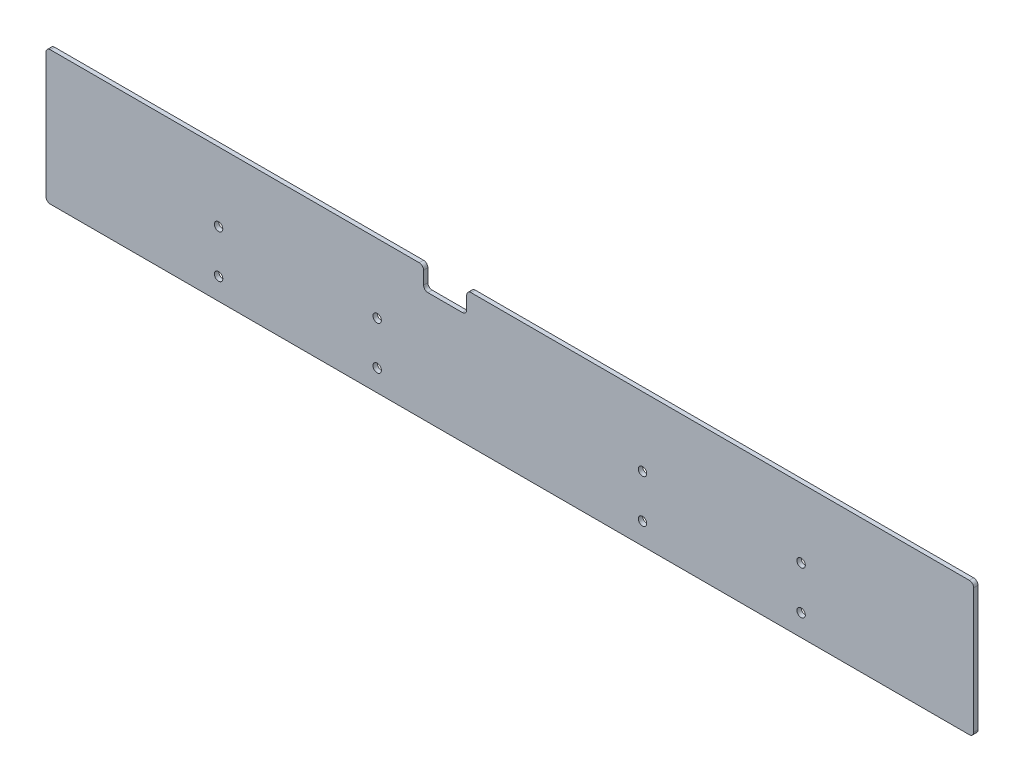
ISO-10303-21;
HEADER;
FILE_DESCRIPTION(('STEP AP214'),'2;1');
FILE_NAME('part.step','',(''),(''),'','','');
FILE_SCHEMA(('AUTOMOTIVE_DESIGN { 1 0 10303 214 1 1 1 1 }'));
ENDSEC;
DATA;
#1=APPLICATION_CONTEXT('core data for automotive mechanical design processes');
#2=APPLICATION_PROTOCOL_DEFINITION('international standard','automotive_design',2000,#1);
#3=PRODUCT_CONTEXT('',#1,'mechanical');
#4=PRODUCT('Part','Part','',(#3));
#5=PRODUCT_RELATED_PRODUCT_CATEGORY('part','',(#4));
#6=PRODUCT_DEFINITION_FORMATION('','',#4);
#7=PRODUCT_DEFINITION_CONTEXT('part definition',#1,'design');
#8=PRODUCT_DEFINITION('design','',#6,#7);
#9=PRODUCT_DEFINITION_SHAPE('','',#8);
#10=(LENGTH_UNIT() NAMED_UNIT(*) SI_UNIT(.MILLI.,.METRE.));
#11=(NAMED_UNIT(*) PLANE_ANGLE_UNIT() SI_UNIT($,.RADIAN.));
#12=(NAMED_UNIT(*) SI_UNIT($,.STERADIAN.) SOLID_ANGLE_UNIT());
#13=UNCERTAINTY_MEASURE_WITH_UNIT(LENGTH_MEASURE(1.E-05),#10,'distance_accuracy_value','');
#14=(GEOMETRIC_REPRESENTATION_CONTEXT(3) GLOBAL_UNCERTAINTY_ASSIGNED_CONTEXT((#13)) GLOBAL_UNIT_ASSIGNED_CONTEXT((#10,
#11,#12)) REPRESENTATION_CONTEXT('',''));
#15=CARTESIAN_POINT('',(0.,0.,0.));
#16=DIRECTION('',(0.,0.,1.));
#17=DIRECTION('',(1.,0.,0.));
#18=AXIS2_PLACEMENT_3D('',#15,#16,#17);
#19=CARTESIAN_POINT('',(0.,0.,2.));
#20=DIRECTION('',(0.,0.,1.));
#21=DIRECTION('',(1.,0.,0.));
#22=AXIS2_PLACEMENT_3D('',#19,#20,#21);
#23=PLANE('',#22);
#24=CARTESIAN_POINT('',(-276.905896290942,-34.2964824120603,2.));
#25=DIRECTION('',(0.,0.,1.));
#26=DIRECTION('',(1.,0.,0.));
#27=AXIS2_PLACEMENT_3D('',#24,#25,#26);
#28=CIRCLE('',#27,1.95000000000003);
#29=CARTESIAN_POINT('',(-274.955896290942,-34.2964824120603,2.));
#30=VERTEX_POINT('',#29);
#31=EDGE_CURVE('E613',#30,#30,#28,.T.);
#32=ORIENTED_EDGE('',*,*,#31,.F.);
#33=EDGE_LOOP('',(#32));
#34=FACE_BOUND('',#33,.T.);
#35=CARTESIAN_POINT('',(-6.905896290942,-14.2964824120603,2.));
#36=DIRECTION('',(0.,0.,1.));
#37=DIRECTION('',(1.,0.,0.));
#38=AXIS2_PLACEMENT_3D('',#35,#36,#37);
#39=CIRCLE('',#38,1.95);
#40=CARTESIAN_POINT('',(-4.955896290942,-14.2964824120603,2.));
#41=VERTEX_POINT('',#40);
#42=EDGE_CURVE('E614',#41,#41,#39,.T.);
#43=ORIENTED_EDGE('',*,*,#42,.F.);
#44=EDGE_LOOP('',(#43));
#45=FACE_BOUND('',#44,.T.);
#46=CARTESIAN_POINT('',(-6.905896290942,-34.2964824120603,2.));
#47=DIRECTION('',(0.,0.,1.));
#48=DIRECTION('',(1.,0.,0.));
#49=AXIS2_PLACEMENT_3D('',#46,#47,#48);
#50=CIRCLE('',#49,1.95);
#51=CARTESIAN_POINT('',(-4.955896290942,-34.2964824120603,2.));
#52=VERTEX_POINT('',#51);
#53=EDGE_CURVE('E618',#52,#52,#50,.T.);
#54=ORIENTED_EDGE('',*,*,#53,.F.);
#55=EDGE_LOOP('',(#54));
#56=FACE_BOUND('',#55,.T.);
#57=CARTESIAN_POINT('',(-276.905896290942,-14.2964824120603,2.));
#58=DIRECTION('',(0.,0.,1.));
#59=DIRECTION('',(1.,0.,0.));
#60=AXIS2_PLACEMENT_3D('',#57,#58,#59);
#61=CIRCLE('',#60,1.95000000000003);
#62=CARTESIAN_POINT('',(-274.955896290942,-14.2964824120603,2.));
#63=VERTEX_POINT('',#62);
#64=EDGE_CURVE('E248',#63,#63,#61,.T.);
#65=ORIENTED_EDGE('',*,*,#64,.F.);
#66=EDGE_LOOP('',(#65));
#67=FACE_BOUND('',#66,.T.);
#68=CARTESIAN_POINT('',(-203.405896290942,-14.2964824120603,2.));
#69=DIRECTION('',(0.,0.,1.));
#70=DIRECTION('',(1.,0.,0.));
#71=AXIS2_PLACEMENT_3D('',#68,#69,#70);
#72=CIRCLE('',#71,1.95);
#73=CARTESIAN_POINT('',(-201.455896290942,-14.2964824120603,2.));
#74=VERTEX_POINT('',#73);
#75=EDGE_CURVE('E268',#74,#74,#72,.T.);
#76=ORIENTED_EDGE('',*,*,#75,.F.);
#77=EDGE_LOOP('',(#76));
#78=FACE_BOUND('',#77,.T.);
#79=CARTESIAN_POINT('',(-80.405896290942,-14.2964824120603,2.));
#80=DIRECTION('',(0.,0.,1.));
#81=DIRECTION('',(1.,0.,0.));
#82=AXIS2_PLACEMENT_3D('',#79,#80,#81);
#83=CIRCLE('',#82,1.95);
#84=CARTESIAN_POINT('',(-78.455896290942,-14.2964824120603,2.));
#85=VERTEX_POINT('',#84);
#86=EDGE_CURVE('E280',#85,#85,#83,.T.);
#87=ORIENTED_EDGE('',*,*,#86,.F.);
#88=EDGE_LOOP('',(#87));
#89=FACE_BOUND('',#88,.T.);
#90=DIRECTION('',(0.,1.,0.));
#91=VECTOR('',#90,1.);
#92=CARTESIAN_POINT('',(-181.905896290942,17.7035175879397,2.));
#93=LINE('',#92,#91);
#94=CARTESIAN_POINT('',(-181.905896290942,9.70351758793974,2.));
#95=VERTEX_POINT('',#94);
#96=CARTESIAN_POINT('',(-181.905896290942,15.7035175879397,2.));
#97=VERTEX_POINT('',#96);
#98=EDGE_CURVE('E169',#95,#97,#93,.T.);
#99=ORIENTED_EDGE('',*,*,#98,.T.);
#100=CARTESIAN_POINT('',(-183.905896290942,15.7035175879397,2.));
#101=DIRECTION('',(0.,0.,1.));
#102=DIRECTION('',(1.,0.,0.));
#103=AXIS2_PLACEMENT_3D('',#100,#101,#102);
#104=CIRCLE('',#103,2.);
#105=CARTESIAN_POINT('',(-183.905896290942,17.7035175879397,2.));
#106=VERTEX_POINT('',#105);
#107=EDGE_CURVE('E217',#97,#106,#104,.T.);
#108=ORIENTED_EDGE('',*,*,#107,.T.);
#109=DIRECTION('',(-1.,0.,0.));
#110=VECTOR('',#109,1.);
#111=CARTESIAN_POINT('',(-356.905896290942,17.7035175879397,2.));
#112=LINE('',#111,#110);
#113=CARTESIAN_POINT('',(-354.905896290942,17.7035175879397,2.));
#114=VERTEX_POINT('',#113);
#115=EDGE_CURVE('E187',#106,#114,#112,.T.);
#116=ORIENTED_EDGE('',*,*,#115,.T.);
#117=CARTESIAN_POINT('',(-354.905896290942,15.7035175879397,2.));
#118=DIRECTION('',(0.,0.,1.));
#119=DIRECTION('',(1.,0.,0.));
#120=AXIS2_PLACEMENT_3D('',#117,#118,#119);
#121=CIRCLE('',#120,2.);
#122=CARTESIAN_POINT('',(-356.905896290942,15.7035175879397,2.));
#123=VERTEX_POINT('',#122);
#124=EDGE_CURVE('E208',#114,#123,#121,.T.);
#125=ORIENTED_EDGE('',*,*,#124,.T.);
#126=DIRECTION('',(0.,-1.,0.));
#127=VECTOR('',#126,1.);
#128=CARTESIAN_POINT('',(-356.905896290942,17.7035175879397,2.));
#129=LINE('',#128,#127);
#130=CARTESIAN_POINT('',(-356.905896290942,-42.2964824120603,2.));
#131=VERTEX_POINT('',#130);
#132=EDGE_CURVE('E181',#123,#131,#129,.T.);
#133=ORIENTED_EDGE('',*,*,#132,.T.);
#134=CARTESIAN_POINT('',(-354.905896290942,-42.2964824120603,2.));
#135=DIRECTION('',(0.,0.,1.));
#136=DIRECTION('',(1.,0.,0.));
#137=AXIS2_PLACEMENT_3D('',#134,#135,#136);
#138=CIRCLE('',#137,2.);
#139=CARTESIAN_POINT('',(-354.905896290942,-44.2964824120603,2.));
#140=VERTEX_POINT('',#139);
#141=EDGE_CURVE('E210',#131,#140,#138,.T.);
#142=ORIENTED_EDGE('',*,*,#141,.T.);
#143=DIRECTION('',(1.,0.,0.));
#144=VECTOR('',#143,1.);
#145=CARTESIAN_POINT('',(-356.905896290942,-44.2964824120603,2.));
#146=LINE('',#145,#144);
#147=CARTESIAN_POINT('',(71.094103709058,-44.2964824120603,2.));
#148=VERTEX_POINT('',#147);
#149=EDGE_CURVE('E288',#140,#148,#146,.T.);
#150=ORIENTED_EDGE('',*,*,#149,.T.);
#151=CARTESIAN_POINT('',(71.094103709058,-42.2964824120603,2.));
#152=DIRECTION('',(0.,0.,1.));
#153=DIRECTION('',(1.,0.,0.));
#154=AXIS2_PLACEMENT_3D('',#151,#152,#153);
#155=CIRCLE('',#154,2.);
#156=CARTESIAN_POINT('',(73.094103709058,-42.2964824120603,2.));
#157=VERTEX_POINT('',#156);
#158=EDGE_CURVE('E212',#148,#157,#155,.T.);
#159=ORIENTED_EDGE('',*,*,#158,.T.);
#160=DIRECTION('',(0.,1.,0.));
#161=VECTOR('',#160,1.);
#162=CARTESIAN_POINT('',(73.094103709058,17.7035175879397,2.));
#163=LINE('',#162,#161);
#164=CARTESIAN_POINT('',(73.094103709058,15.7035175879397,2.));
#165=VERTEX_POINT('',#164);
#166=EDGE_CURVE('E291',#157,#165,#163,.T.);
#167=ORIENTED_EDGE('',*,*,#166,.T.);
#168=CARTESIAN_POINT('',(71.094103709058,15.7035175879397,2.));
#169=DIRECTION('',(0.,0.,1.));
#170=DIRECTION('',(1.,0.,0.));
#171=AXIS2_PLACEMENT_3D('',#168,#169,#170);
#172=CIRCLE('',#171,2.);
#173=CARTESIAN_POINT('',(71.094103709058,17.7035175879397,2.));
#174=VERTEX_POINT('',#173);
#175=EDGE_CURVE('E214',#165,#174,#172,.T.);
#176=ORIENTED_EDGE('',*,*,#175,.T.);
#177=DIRECTION('',(-1.,0.,0.));
#178=VECTOR('',#177,1.);
#179=CARTESIAN_POINT('',(-161.905896290942,17.7035175879397,2.));
#180=LINE('',#179,#178);
#181=CARTESIAN_POINT('',(-159.905896290942,17.7035175879397,2.));
#182=VERTEX_POINT('',#181);
#183=EDGE_CURVE('E294',#174,#182,#180,.T.);
#184=ORIENTED_EDGE('',*,*,#183,.T.);
#185=CARTESIAN_POINT('',(-159.905896290942,15.7035175879397,2.));
#186=DIRECTION('',(0.,0.,1.));
#187=DIRECTION('',(1.,0.,0.));
#188=AXIS2_PLACEMENT_3D('',#185,#186,#187);
#189=CIRCLE('',#188,2.);
#190=CARTESIAN_POINT('',(-161.905896290942,15.7035175879397,2.));
#191=VERTEX_POINT('',#190);
#192=EDGE_CURVE('E57',#182,#191,#189,.T.);
#193=ORIENTED_EDGE('',*,*,#192,.T.);
#194=DIRECTION('',(0.,-1.,0.));
#195=VECTOR('',#194,1.);
#196=CARTESIAN_POINT('',(-161.905896290942,17.7035175879397,2.));
#197=LINE('',#196,#195);
#198=CARTESIAN_POINT('',(-161.905896290942,9.70351758793974,2.));
#199=VERTEX_POINT('',#198);
#200=EDGE_CURVE('E296',#191,#199,#197,.T.);
#201=ORIENTED_EDGE('',*,*,#200,.T.);
#202=CARTESIAN_POINT('',(-163.905896290942,9.70351758793974,2.));
#203=DIRECTION('',(0.,0.,1.));
#204=DIRECTION('',(1.,0.,0.));
#205=AXIS2_PLACEMENT_3D('',#202,#203,#204);
#206=CIRCLE('',#205,2.);
#207=CARTESIAN_POINT('',(-163.905896290942,7.70351758793974,2.));
#208=VERTEX_POINT('',#207);
#209=EDGE_CURVE('E11',#199,#208,#206,.F.);
#210=ORIENTED_EDGE('',*,*,#209,.T.);
#211=DIRECTION('',(-1.,0.,0.));
#212=VECTOR('',#211,1.);
#213=CARTESIAN_POINT('',(-181.905896290942,7.70351758793974,2.));
#214=LINE('',#213,#212);
#215=CARTESIAN_POINT('',(-179.905896290942,7.70351758793974,2.));
#216=VERTEX_POINT('',#215);
#217=EDGE_CURVE('E298',#208,#216,#214,.T.);
#218=ORIENTED_EDGE('',*,*,#217,.T.);
#219=CARTESIAN_POINT('',(-179.905896290942,9.70351758793974,2.));
#220=DIRECTION('',(0.,0.,1.));
#221=DIRECTION('',(1.,0.,0.));
#222=AXIS2_PLACEMENT_3D('',#219,#220,#221);
#223=CIRCLE('',#222,2.);
#224=EDGE_CURVE('E159',#216,#95,#223,.F.);
#225=ORIENTED_EDGE('',*,*,#224,.T.);
#226=EDGE_LOOP('',(#99,#108,#116,#125,#133,#142,#150,#159,#167,#176,#184,#193,#201,#210,#218,#225));
#227=FACE_BOUND('',#226,.T.);
#228=CARTESIAN_POINT('',(-80.405896290942,-34.2964824120603,2.));
#229=DIRECTION('',(0.,0.,1.));
#230=DIRECTION('',(1.,0.,0.));
#231=AXIS2_PLACEMENT_3D('',#228,#229,#230);
#232=CIRCLE('',#231,1.95);
#233=CARTESIAN_POINT('',(-78.455896290942,-34.2964824120603,2.));
#234=VERTEX_POINT('',#233);
#235=EDGE_CURVE('E274',#234,#234,#232,.T.);
#236=ORIENTED_EDGE('',*,*,#235,.F.);
#237=EDGE_LOOP('',(#236));
#238=FACE_BOUND('',#237,.T.);
#239=CARTESIAN_POINT('',(-203.405896290942,-34.2964824120603,2.));
#240=DIRECTION('',(0.,0.,1.));
#241=DIRECTION('',(1.,0.,0.));
#242=AXIS2_PLACEMENT_3D('',#239,#240,#241);
#243=CIRCLE('',#242,1.95);
#244=CARTESIAN_POINT('',(-201.455896290942,-34.2964824120603,2.));
#245=VERTEX_POINT('',#244);
#246=EDGE_CURVE('E259',#245,#245,#243,.T.);
#247=ORIENTED_EDGE('',*,*,#246,.F.);
#248=EDGE_LOOP('',(#247));
#249=FACE_BOUND('',#248,.T.);
#250=ADVANCED_FACE('F33',(#34,#45,#56,#67,#78,#89,#227,#238,#249),#23,.T.);
#251=CARTESIAN_POINT('',(0.,0.,0.));
#252=DIRECTION('',(0.,0.,1.));
#253=DIRECTION('',(1.,0.,0.));
#254=AXIS2_PLACEMENT_3D('',#251,#252,#253);
#255=PLANE('',#254);
#256=CARTESIAN_POINT('',(-276.905896290942,-34.2964824120603,0.));
#257=DIRECTION('',(0.,0.,1.));
#258=DIRECTION('',(1.,0.,0.));
#259=AXIS2_PLACEMENT_3D('',#256,#257,#258);
#260=CIRCLE('',#259,1.95000000000003);
#261=CARTESIAN_POINT('',(-274.955896290942,-34.2964824120603,0.));
#262=VERTEX_POINT('',#261);
#263=EDGE_CURVE('E37',#262,#262,#260,.T.);
#264=ORIENTED_EDGE('',*,*,#263,.T.);
#265=EDGE_LOOP('',(#264));
#266=FACE_BOUND('',#265,.T.);
#267=CARTESIAN_POINT('',(-6.905896290942,-14.2964824120603,0.));
#268=DIRECTION('',(0.,0.,1.));
#269=DIRECTION('',(1.,0.,0.));
#270=AXIS2_PLACEMENT_3D('',#267,#268,#269);
#271=CIRCLE('',#270,1.95);
#272=CARTESIAN_POINT('',(-4.955896290942,-14.2964824120603,0.));
#273=VERTEX_POINT('',#272);
#274=EDGE_CURVE('E250',#273,#273,#271,.T.);
#275=ORIENTED_EDGE('',*,*,#274,.T.);
#276=EDGE_LOOP('',(#275));
#277=FACE_BOUND('',#276,.T.);
#278=CARTESIAN_POINT('',(-6.905896290942,-34.2964824120603,0.));
#279=DIRECTION('',(0.,0.,1.));
#280=DIRECTION('',(1.,0.,0.));
#281=AXIS2_PLACEMENT_3D('',#278,#279,#280);
#282=CIRCLE('',#281,1.95);
#283=CARTESIAN_POINT('',(-4.955896290942,-34.2964824120603,0.));
#284=VERTEX_POINT('',#283);
#285=EDGE_CURVE('E247',#284,#284,#282,.T.);
#286=ORIENTED_EDGE('',*,*,#285,.T.);
#287=EDGE_LOOP('',(#286));
#288=FACE_BOUND('',#287,.T.);
#289=CARTESIAN_POINT('',(-276.905896290942,-14.2964824120603,0.));
#290=DIRECTION('',(0.,0.,1.));
#291=DIRECTION('',(1.,0.,0.));
#292=AXIS2_PLACEMENT_3D('',#289,#290,#291);
#293=CIRCLE('',#292,1.95000000000003);
#294=CARTESIAN_POINT('',(-274.955896290942,-14.2964824120603,0.));
#295=VERTEX_POINT('',#294);
#296=EDGE_CURVE('E244',#295,#295,#293,.T.);
#297=ORIENTED_EDGE('',*,*,#296,.T.);
#298=EDGE_LOOP('',(#297));
#299=FACE_BOUND('',#298,.T.);
#300=DIRECTION('',(-1.,0.,0.));
#301=VECTOR('',#300,1.);
#302=CARTESIAN_POINT('',(-356.905896290942,17.7035175879397,0.));
#303=LINE('',#302,#301);
#304=CARTESIAN_POINT('',(-183.905896290942,17.7035175879397,0.));
#305=VERTEX_POINT('',#304);
#306=CARTESIAN_POINT('',(-354.905896290942,17.7035175879397,0.));
#307=VERTEX_POINT('',#306);
#308=EDGE_CURVE('E177',#305,#307,#303,.T.);
#309=ORIENTED_EDGE('',*,*,#308,.F.);
#310=CARTESIAN_POINT('',(-183.905896290942,15.7035175879397,0.));
#311=DIRECTION('',(0.,0.,1.));
#312=DIRECTION('',(1.,0.,0.));
#313=AXIS2_PLACEMENT_3D('',#310,#311,#312);
#314=CIRCLE('',#313,2.);
#315=CARTESIAN_POINT('',(-181.905896290942,15.7035175879397,0.));
#316=VERTEX_POINT('',#315);
#317=EDGE_CURVE('E176',#305,#316,#314,.F.);
#318=ORIENTED_EDGE('',*,*,#317,.T.);
#319=DIRECTION('',(0.,1.,0.));
#320=VECTOR('',#319,1.);
#321=CARTESIAN_POINT('',(-181.905896290942,17.7035175879397,0.));
#322=LINE('',#321,#320);
#323=CARTESIAN_POINT('',(-181.905896290942,9.70351758793974,0.));
#324=VERTEX_POINT('',#323);
#325=EDGE_CURVE('E166',#324,#316,#322,.T.);
#326=ORIENTED_EDGE('',*,*,#325,.F.);
#327=CARTESIAN_POINT('',(-179.905896290942,9.70351758793974,0.));
#328=DIRECTION('',(0.,0.,1.));
#329=DIRECTION('',(1.,0.,0.));
#330=AXIS2_PLACEMENT_3D('',#327,#328,#329);
#331=CIRCLE('',#330,2.);
#332=CARTESIAN_POINT('',(-179.905896290942,7.70351758793974,0.));
#333=VERTEX_POINT('',#332);
#334=EDGE_CURVE('E149',#324,#333,#331,.T.);
#335=ORIENTED_EDGE('',*,*,#334,.T.);
#336=DIRECTION('',(-1.,0.,0.));
#337=VECTOR('',#336,1.);
#338=CARTESIAN_POINT('',(-181.905896290942,7.70351758793974,0.));
#339=LINE('',#338,#337);
#340=CARTESIAN_POINT('',(-163.905896290942,7.70351758793974,0.));
#341=VERTEX_POINT('',#340);
#342=EDGE_CURVE('E178',#341,#333,#339,.T.);
#343=ORIENTED_EDGE('',*,*,#342,.F.);
#344=CARTESIAN_POINT('',(-163.905896290942,9.70351758793974,0.));
#345=DIRECTION('',(0.,0.,1.));
#346=DIRECTION('',(1.,0.,0.));
#347=AXIS2_PLACEMENT_3D('',#344,#345,#346);
#348=CIRCLE('',#347,2.);
#349=CARTESIAN_POINT('',(-161.905896290942,9.70351758793974,0.));
#350=VERTEX_POINT('',#349);
#351=EDGE_CURVE('E42',#341,#350,#348,.T.);
#352=ORIENTED_EDGE('',*,*,#351,.T.);
#353=DIRECTION('',(0.,-1.,0.));
#354=VECTOR('',#353,1.);
#355=CARTESIAN_POINT('',(-161.905896290942,17.7035175879397,0.));
#356=LINE('',#355,#354);
#357=CARTESIAN_POINT('',(-161.905896290942,15.7035175879397,0.));
#358=VERTEX_POINT('',#357);
#359=EDGE_CURVE('E183',#358,#350,#356,.T.);
#360=ORIENTED_EDGE('',*,*,#359,.F.);
#361=CARTESIAN_POINT('',(-159.905896290942,15.7035175879397,0.));
#362=DIRECTION('',(0.,0.,1.));
#363=DIRECTION('',(1.,0.,0.));
#364=AXIS2_PLACEMENT_3D('',#361,#362,#363);
#365=CIRCLE('',#364,2.);
#366=CARTESIAN_POINT('',(-159.905896290942,17.7035175879397,0.));
#367=VERTEX_POINT('',#366);
#368=EDGE_CURVE('E205',#358,#367,#365,.F.);
#369=ORIENTED_EDGE('',*,*,#368,.T.);
#370=DIRECTION('',(-1.,0.,0.));
#371=VECTOR('',#370,1.);
#372=CARTESIAN_POINT('',(-161.905896290942,17.7035175879397,0.));
#373=LINE('',#372,#371);
#374=CARTESIAN_POINT('',(71.094103709058,17.7035175879397,0.));
#375=VERTEX_POINT('',#374);
#376=EDGE_CURVE('E312',#375,#367,#373,.T.);
#377=ORIENTED_EDGE('',*,*,#376,.F.);
#378=CARTESIAN_POINT('',(71.094103709058,15.7035175879397,0.));
#379=DIRECTION('',(0.,0.,1.));
#380=DIRECTION('',(1.,0.,0.));
#381=AXIS2_PLACEMENT_3D('',#378,#379,#380);
#382=CIRCLE('',#381,2.);
#383=CARTESIAN_POINT('',(73.094103709058,15.7035175879397,0.));
#384=VERTEX_POINT('',#383);
#385=EDGE_CURVE('E203',#375,#384,#382,.F.);
#386=ORIENTED_EDGE('',*,*,#385,.T.);
#387=DIRECTION('',(0.,1.,0.));
#388=VECTOR('',#387,1.);
#389=CARTESIAN_POINT('',(73.094103709058,17.7035175879397,0.));
#390=LINE('',#389,#388);
#391=CARTESIAN_POINT('',(73.094103709058,-42.2964824120603,0.));
#392=VERTEX_POINT('',#391);
#393=EDGE_CURVE('E309',#392,#384,#390,.T.);
#394=ORIENTED_EDGE('',*,*,#393,.F.);
#395=CARTESIAN_POINT('',(71.094103709058,-42.2964824120603,0.));
#396=DIRECTION('',(0.,0.,1.));
#397=DIRECTION('',(1.,0.,0.));
#398=AXIS2_PLACEMENT_3D('',#395,#396,#397);
#399=CIRCLE('',#398,2.);
#400=CARTESIAN_POINT('',(71.094103709058,-44.2964824120603,0.));
#401=VERTEX_POINT('',#400);
#402=EDGE_CURVE('E201',#392,#401,#399,.F.);
#403=ORIENTED_EDGE('',*,*,#402,.T.);
#404=DIRECTION('',(1.,0.,0.));
#405=VECTOR('',#404,1.);
#406=CARTESIAN_POINT('',(-356.905896290942,-44.2964824120603,0.));
#407=LINE('',#406,#405);
#408=CARTESIAN_POINT('',(-354.905896290942,-44.2964824120603,0.));
#409=VERTEX_POINT('',#408);
#410=EDGE_CURVE('E306',#409,#401,#407,.T.);
#411=ORIENTED_EDGE('',*,*,#410,.F.);
#412=CARTESIAN_POINT('',(-354.905896290942,-42.2964824120603,0.));
#413=DIRECTION('',(0.,0.,1.));
#414=DIRECTION('',(1.,0.,0.));
#415=AXIS2_PLACEMENT_3D('',#412,#413,#414);
#416=CIRCLE('',#415,2.);
#417=CARTESIAN_POINT('',(-356.905896290942,-42.2964824120603,0.));
#418=VERTEX_POINT('',#417);
#419=EDGE_CURVE('E199',#409,#418,#416,.F.);
#420=ORIENTED_EDGE('',*,*,#419,.T.);
#421=DIRECTION('',(0.,-1.,0.));
#422=VECTOR('',#421,1.);
#423=CARTESIAN_POINT('',(-356.905896290942,17.7035175879397,0.));
#424=LINE('',#423,#422);
#425=CARTESIAN_POINT('',(-356.905896290942,15.7035175879397,0.));
#426=VERTEX_POINT('',#425);
#427=EDGE_CURVE('E283',#426,#418,#424,.T.);
#428=ORIENTED_EDGE('',*,*,#427,.F.);
#429=CARTESIAN_POINT('',(-354.905896290942,15.7035175879397,0.));
#430=DIRECTION('',(0.,0.,1.));
#431=DIRECTION('',(1.,0.,0.));
#432=AXIS2_PLACEMENT_3D('',#429,#430,#431);
#433=CIRCLE('',#432,2.);
#434=EDGE_CURVE('E197',#426,#307,#433,.F.);
#435=ORIENTED_EDGE('',*,*,#434,.T.);
#436=EDGE_LOOP('',(#309,#318,#326,#335,#343,#352,#360,#369,#377,#386,#394,#403,#411,#420,#428,#435));
#437=FACE_BOUND('',#436,.T.);
#438=CARTESIAN_POINT('',(-80.405896290942,-14.2964824120603,0.));
#439=DIRECTION('',(0.,0.,1.));
#440=DIRECTION('',(1.,0.,0.));
#441=AXIS2_PLACEMENT_3D('',#438,#439,#440);
#442=CIRCLE('',#441,1.95);
#443=CARTESIAN_POINT('',(-78.455896290942,-14.2964824120603,0.));
#444=VERTEX_POINT('',#443);
#445=EDGE_CURVE('E277',#444,#444,#442,.T.);
#446=ORIENTED_EDGE('',*,*,#445,.T.);
#447=EDGE_LOOP('',(#446));
#448=FACE_BOUND('',#447,.T.);
#449=CARTESIAN_POINT('',(-80.405896290942,-34.2964824120603,0.));
#450=DIRECTION('',(0.,0.,1.));
#451=DIRECTION('',(1.,0.,0.));
#452=AXIS2_PLACEMENT_3D('',#449,#450,#451);
#453=CIRCLE('',#452,1.95);
#454=CARTESIAN_POINT('',(-78.455896290942,-34.2964824120603,0.));
#455=VERTEX_POINT('',#454);
#456=EDGE_CURVE('E271',#455,#455,#453,.T.);
#457=ORIENTED_EDGE('',*,*,#456,.T.);
#458=EDGE_LOOP('',(#457));
#459=FACE_BOUND('',#458,.T.);
#460=CARTESIAN_POINT('',(-203.405896290942,-14.2964824120603,0.));
#461=DIRECTION('',(0.,0.,1.));
#462=DIRECTION('',(1.,0.,0.));
#463=AXIS2_PLACEMENT_3D('',#460,#461,#462);
#464=CIRCLE('',#463,1.95);
#465=CARTESIAN_POINT('',(-201.455896290942,-14.2964824120603,0.));
#466=VERTEX_POINT('',#465);
#467=EDGE_CURVE('E264',#466,#466,#464,.T.);
#468=ORIENTED_EDGE('',*,*,#467,.T.);
#469=EDGE_LOOP('',(#468));
#470=FACE_BOUND('',#469,.T.);
#471=CARTESIAN_POINT('',(-203.405896290942,-34.2964824120603,0.));
#472=DIRECTION('',(0.,0.,1.));
#473=DIRECTION('',(1.,0.,0.));
#474=AXIS2_PLACEMENT_3D('',#471,#472,#473);
#475=CIRCLE('',#474,1.95);
#476=CARTESIAN_POINT('',(-201.455896290942,-34.2964824120603,0.));
#477=VERTEX_POINT('',#476);
#478=EDGE_CURVE('E255',#477,#477,#475,.T.);
#479=ORIENTED_EDGE('',*,*,#478,.T.);
#480=EDGE_LOOP('',(#479));
#481=FACE_BOUND('',#480,.T.);
#482=ADVANCED_FACE('F174',(#266,#277,#288,#299,#437,#448,#459,#470,#481),#255,.F.);
#483=CARTESIAN_POINT('',(-356.905896290942,17.7035175879397,2.));
#484=DIRECTION('',(1.,0.,0.));
#485=DIRECTION('',(0.,0.,-1.));
#486=AXIS2_PLACEMENT_3D('',#483,#484,#485);
#487=PLANE('',#486);
#488=ORIENTED_EDGE('',*,*,#427,.T.);
#489=DIRECTION('',(0.,0.,-1.));
#490=VECTOR('',#489,1.);
#491=CARTESIAN_POINT('',(-356.905896290942,-42.2964824120603,2.));
#492=LINE('',#491,#490);
#493=EDGE_CURVE('E160',#418,#131,#492,.F.);
#494=ORIENTED_EDGE('',*,*,#493,.T.);
#495=ORIENTED_EDGE('',*,*,#132,.F.);
#496=DIRECTION('',(0.,0.,-1.));
#497=VECTOR('',#496,1.);
#498=CARTESIAN_POINT('',(-356.905896290942,15.7035175879397,2.));
#499=LINE('',#498,#497);
#500=EDGE_CURVE('E238',#123,#426,#499,.T.);
#501=ORIENTED_EDGE('',*,*,#500,.T.);
#502=EDGE_LOOP('',(#488,#494,#495,#501));
#503=FACE_BOUND('',#502,.T.);
#504=ADVANCED_FACE('F341',(#503),#487,.F.);
#505=CARTESIAN_POINT('',(-356.905896290942,-44.2964824120603,2.));
#506=DIRECTION('',(0.,1.,0.));
#507=DIRECTION('',(0.,0.,1.));
#508=AXIS2_PLACEMENT_3D('',#505,#506,#507);
#509=PLANE('',#508);
#510=ORIENTED_EDGE('',*,*,#410,.T.);
#511=DIRECTION('',(0.,0.,-1.));
#512=VECTOR('',#511,1.);
#513=CARTESIAN_POINT('',(71.094103709058,-44.2964824120603,2.));
#514=LINE('',#513,#512);
#515=EDGE_CURVE('E236',#401,#148,#514,.F.);
#516=ORIENTED_EDGE('',*,*,#515,.T.);
#517=ORIENTED_EDGE('',*,*,#149,.F.);
#518=DIRECTION('',(0.,0.,-1.));
#519=VECTOR('',#518,1.);
#520=CARTESIAN_POINT('',(-354.905896290942,-44.2964824120603,2.));
#521=LINE('',#520,#519);
#522=EDGE_CURVE('E233',#140,#409,#521,.T.);
#523=ORIENTED_EDGE('',*,*,#522,.T.);
#524=EDGE_LOOP('',(#510,#516,#517,#523));
#525=FACE_BOUND('',#524,.T.);
#526=ADVANCED_FACE('F400',(#525),#509,.F.);
#527=CARTESIAN_POINT('',(73.094103709058,17.7035175879397,2.));
#528=DIRECTION('',(-1.,0.,0.));
#529=DIRECTION('',(0.,0.,1.));
#530=AXIS2_PLACEMENT_3D('',#527,#528,#529);
#531=PLANE('',#530);
#532=ORIENTED_EDGE('',*,*,#393,.T.);
#533=DIRECTION('',(0.,0.,-1.));
#534=VECTOR('',#533,1.);
#535=CARTESIAN_POINT('',(73.094103709058,15.7035175879397,2.));
#536=LINE('',#535,#534);
#537=EDGE_CURVE('E231',#384,#165,#536,.F.);
#538=ORIENTED_EDGE('',*,*,#537,.T.);
#539=ORIENTED_EDGE('',*,*,#166,.F.);
#540=DIRECTION('',(0.,0.,-1.));
#541=VECTOR('',#540,1.);
#542=CARTESIAN_POINT('',(73.094103709058,-42.2964824120603,2.));
#543=LINE('',#542,#541);
#544=EDGE_CURVE('E228',#157,#392,#543,.T.);
#545=ORIENTED_EDGE('',*,*,#544,.T.);
#546=EDGE_LOOP('',(#532,#538,#539,#545));
#547=FACE_BOUND('',#546,.T.);
#548=ADVANCED_FACE('F407',(#547),#531,.F.);
#549=CARTESIAN_POINT('',(-161.905896290942,17.7035175879397,2.));
#550=DIRECTION('',(0.,-1.,0.));
#551=DIRECTION('',(0.,0.,-1.));
#552=AXIS2_PLACEMENT_3D('',#549,#550,#551);
#553=PLANE('',#552);
#554=ORIENTED_EDGE('',*,*,#376,.T.);
#555=DIRECTION('',(0.,0.,-1.));
#556=VECTOR('',#555,1.);
#557=CARTESIAN_POINT('',(-159.905896290942,17.7035175879397,2.));
#558=LINE('',#557,#556);
#559=EDGE_CURVE('E226',#367,#182,#558,.F.);
#560=ORIENTED_EDGE('',*,*,#559,.T.);
#561=ORIENTED_EDGE('',*,*,#183,.F.);
#562=DIRECTION('',(0.,0.,-1.));
#563=VECTOR('',#562,1.);
#564=CARTESIAN_POINT('',(71.094103709058,17.7035175879397,2.));
#565=LINE('',#564,#563);
#566=EDGE_CURVE('E223',#174,#375,#565,.T.);
#567=ORIENTED_EDGE('',*,*,#566,.T.);
#568=EDGE_LOOP('',(#554,#560,#561,#567));
#569=FACE_BOUND('',#568,.T.);
#570=ADVANCED_FACE('F333',(#569),#553,.F.);
#571=CARTESIAN_POINT('',(-161.905896290942,17.7035175879397,2.));
#572=DIRECTION('',(1.,0.,0.));
#573=DIRECTION('',(0.,0.,-1.));
#574=AXIS2_PLACEMENT_3D('',#571,#572,#573);
#575=PLANE('',#574);
#576=ORIENTED_EDGE('',*,*,#359,.T.);
#577=DIRECTION('',(0.,0.,-1.));
#578=VECTOR('',#577,1.);
#579=CARTESIAN_POINT('',(-161.905896290942,9.70351758793974,2.));
#580=LINE('',#579,#578);
#581=EDGE_CURVE('E50',#350,#199,#580,.F.);
#582=ORIENTED_EDGE('',*,*,#581,.T.);
#583=ORIENTED_EDGE('',*,*,#200,.F.);
#584=DIRECTION('',(0.,0.,-1.));
#585=VECTOR('',#584,1.);
#586=CARTESIAN_POINT('',(-161.905896290942,15.7035175879397,2.));
#587=LINE('',#586,#585);
#588=EDGE_CURVE('E219',#191,#358,#587,.T.);
#589=ORIENTED_EDGE('',*,*,#588,.T.);
#590=EDGE_LOOP('',(#576,#582,#583,#589));
#591=FACE_BOUND('',#590,.T.);
#592=ADVANCED_FACE('F315',(#591),#575,.F.);
#593=CARTESIAN_POINT('',(-181.905896290942,7.70351758793974,2.));
#594=DIRECTION('',(0.,-1.,0.));
#595=DIRECTION('',(0.,0.,-1.));
#596=AXIS2_PLACEMENT_3D('',#593,#594,#595);
#597=PLANE('',#596);
#598=ORIENTED_EDGE('',*,*,#342,.T.);
#599=DIRECTION('',(0.,0.,-1.));
#600=VECTOR('',#599,1.);
#601=CARTESIAN_POINT('',(-179.905896290942,7.70351758793974,2.));
#602=LINE('',#601,#600);
#603=EDGE_CURVE('E154',#333,#216,#602,.F.);
#604=ORIENTED_EDGE('',*,*,#603,.T.);
#605=ORIENTED_EDGE('',*,*,#217,.F.);
#606=DIRECTION('',(0.,0.,-1.));
#607=VECTOR('',#606,1.);
#608=CARTESIAN_POINT('',(-163.905896290942,7.70351758793974,0.));
#609=LINE('',#608,#607);
#610=EDGE_CURVE('E170',#208,#341,#609,.T.);
#611=ORIENTED_EDGE('',*,*,#610,.T.);
#612=EDGE_LOOP('',(#598,#604,#605,#611));
#613=FACE_BOUND('',#612,.T.);
#614=ADVANCED_FACE('F324',(#613),#597,.F.);
#615=CARTESIAN_POINT('',(-181.905896290942,17.7035175879397,2.));
#616=DIRECTION('',(-1.,0.,0.));
#617=DIRECTION('',(0.,0.,1.));
#618=AXIS2_PLACEMENT_3D('',#615,#616,#617);
#619=PLANE('',#618);
#620=ORIENTED_EDGE('',*,*,#98,.F.);
#621=DIRECTION('',(0.,0.,-1.));
#622=VECTOR('',#621,1.);
#623=CARTESIAN_POINT('',(-181.905896290942,9.70351758793974,0.));
#624=LINE('',#623,#622);
#625=EDGE_CURVE('E153',#95,#324,#624,.T.);
#626=ORIENTED_EDGE('',*,*,#625,.T.);
#627=ORIENTED_EDGE('',*,*,#325,.T.);
#628=DIRECTION('',(0.,0.,-1.));
#629=VECTOR('',#628,1.);
#630=CARTESIAN_POINT('',(-181.905896290942,15.7035175879397,2.));
#631=LINE('',#630,#629);
#632=EDGE_CURVE('E171',#316,#97,#631,.F.);
#633=ORIENTED_EDGE('',*,*,#632,.T.);
#634=EDGE_LOOP('',(#620,#626,#627,#633));
#635=FACE_BOUND('',#634,.T.);
#636=ADVANCED_FACE('F165',(#635),#619,.F.);
#637=CARTESIAN_POINT('',(-356.905896290942,17.7035175879397,2.));
#638=DIRECTION('',(0.,-1.,0.));
#639=DIRECTION('',(0.,0.,-1.));
#640=AXIS2_PLACEMENT_3D('',#637,#638,#639);
#641=PLANE('',#640);
#642=ORIENTED_EDGE('',*,*,#115,.F.);
#643=DIRECTION('',(0.,0.,-1.));
#644=VECTOR('',#643,1.);
#645=CARTESIAN_POINT('',(-183.905896290942,17.7035175879397,2.));
#646=LINE('',#645,#644);
#647=EDGE_CURVE('E194',#106,#305,#646,.T.);
#648=ORIENTED_EDGE('',*,*,#647,.T.);
#649=ORIENTED_EDGE('',*,*,#308,.T.);
#650=DIRECTION('',(0.,0.,-1.));
#651=VECTOR('',#650,1.);
#652=CARTESIAN_POINT('',(-354.905896290942,17.7035175879397,2.));
#653=LINE('',#652,#651);
#654=EDGE_CURVE('E192',#307,#114,#653,.F.);
#655=ORIENTED_EDGE('',*,*,#654,.T.);
#656=EDGE_LOOP('',(#642,#648,#649,#655));
#657=FACE_BOUND('',#656,.T.);
#658=ADVANCED_FACE('F331',(#657),#641,.F.);
#659=CARTESIAN_POINT('',(-80.405896290942,-14.2964824120603,2.));
#660=DIRECTION('',(0.,0.,-1.));
#661=DIRECTION('',(-1.,0.,0.));
#662=AXIS2_PLACEMENT_3D('',#659,#660,#661);
#663=CYLINDRICAL_SURFACE('',#662,1.95);
#664=ORIENTED_EDGE('',*,*,#86,.T.);
#665=EDGE_LOOP('',(#664));
#666=FACE_BOUND('',#665,.T.);
#667=ORIENTED_EDGE('',*,*,#445,.F.);
#668=EDGE_LOOP('',(#667));
#669=FACE_BOUND('',#668,.T.);
#670=ADVANCED_FACE('F346',(#666,#669),#663,.F.);
#671=CARTESIAN_POINT('',(-80.405896290942,-34.2964824120603,2.));
#672=DIRECTION('',(0.,0.,-1.));
#673=DIRECTION('',(-1.,0.,0.));
#674=AXIS2_PLACEMENT_3D('',#671,#672,#673);
#675=CYLINDRICAL_SURFACE('',#674,1.95);
#676=ORIENTED_EDGE('',*,*,#235,.T.);
#677=EDGE_LOOP('',(#676));
#678=FACE_BOUND('',#677,.T.);
#679=ORIENTED_EDGE('',*,*,#456,.F.);
#680=EDGE_LOOP('',(#679));
#681=FACE_BOUND('',#680,.T.);
#682=ADVANCED_FACE('F354',(#678,#681),#675,.F.);
#683=CARTESIAN_POINT('',(-203.405896290942,-14.2964824120603,2.));
#684=DIRECTION('',(0.,0.,-1.));
#685=DIRECTION('',(-1.,0.,0.));
#686=AXIS2_PLACEMENT_3D('',#683,#684,#685);
#687=CYLINDRICAL_SURFACE('',#686,1.95);
#688=ORIENTED_EDGE('',*,*,#75,.T.);
#689=EDGE_LOOP('',(#688));
#690=FACE_BOUND('',#689,.T.);
#691=ORIENTED_EDGE('',*,*,#467,.F.);
#692=EDGE_LOOP('',(#691));
#693=FACE_BOUND('',#692,.T.);
#694=ADVANCED_FACE('F554',(#690,#693),#687,.F.);
#695=CARTESIAN_POINT('',(-203.405896290942,-34.2964824120603,2.));
#696=DIRECTION('',(0.,0.,-1.));
#697=DIRECTION('',(-1.,0.,0.));
#698=AXIS2_PLACEMENT_3D('',#695,#696,#697);
#699=CYLINDRICAL_SURFACE('',#698,1.95);
#700=ORIENTED_EDGE('',*,*,#246,.T.);
#701=EDGE_LOOP('',(#700));
#702=FACE_BOUND('',#701,.T.);
#703=ORIENTED_EDGE('',*,*,#478,.F.);
#704=EDGE_LOOP('',(#703));
#705=FACE_BOUND('',#704,.T.);
#706=ADVANCED_FACE('F371',(#702,#705),#699,.F.);
#707=CARTESIAN_POINT('',(-179.905896290942,9.70351758793974,2.));
#708=DIRECTION('',(0.,0.,1.));
#709=DIRECTION('',(1.,0.,0.));
#710=AXIS2_PLACEMENT_3D('',#707,#708,#709);
#711=CYLINDRICAL_SURFACE('',#710,2.);
#712=ORIENTED_EDGE('',*,*,#224,.F.);
#713=ORIENTED_EDGE('',*,*,#603,.F.);
#714=ORIENTED_EDGE('',*,*,#334,.F.);
#715=ORIENTED_EDGE('',*,*,#625,.F.);
#716=EDGE_LOOP('',(#712,#713,#714,#715));
#717=FACE_BOUND('',#716,.T.);
#718=ADVANCED_FACE('F152',(#717),#711,.F.);
#719=CARTESIAN_POINT('',(-183.905896290942,15.7035175879397,2.));
#720=DIRECTION('',(0.,0.,-1.));
#721=DIRECTION('',(-1.,0.,0.));
#722=AXIS2_PLACEMENT_3D('',#719,#720,#721);
#723=CYLINDRICAL_SURFACE('',#722,2.);
#724=ORIENTED_EDGE('',*,*,#107,.F.);
#725=ORIENTED_EDGE('',*,*,#632,.F.);
#726=ORIENTED_EDGE('',*,*,#317,.F.);
#727=ORIENTED_EDGE('',*,*,#647,.F.);
#728=EDGE_LOOP('',(#724,#725,#726,#727));
#729=FACE_BOUND('',#728,.T.);
#730=ADVANCED_FACE('F362',(#729),#723,.T.);
#731=CARTESIAN_POINT('',(-163.905896290942,9.70351758793974,2.));
#732=DIRECTION('',(0.,0.,1.));
#733=DIRECTION('',(1.,0.,0.));
#734=AXIS2_PLACEMENT_3D('',#731,#732,#733);
#735=CYLINDRICAL_SURFACE('',#734,2.);
#736=ORIENTED_EDGE('',*,*,#209,.F.);
#737=ORIENTED_EDGE('',*,*,#581,.F.);
#738=ORIENTED_EDGE('',*,*,#351,.F.);
#739=ORIENTED_EDGE('',*,*,#610,.F.);
#740=EDGE_LOOP('',(#736,#737,#738,#739));
#741=FACE_BOUND('',#740,.T.);
#742=ADVANCED_FACE('F319',(#741),#735,.F.);
#743=CARTESIAN_POINT('',(-159.905896290942,15.7035175879397,2.));
#744=DIRECTION('',(0.,0.,-1.));
#745=DIRECTION('',(-1.,0.,0.));
#746=AXIS2_PLACEMENT_3D('',#743,#744,#745);
#747=CYLINDRICAL_SURFACE('',#746,2.);
#748=ORIENTED_EDGE('',*,*,#192,.F.);
#749=ORIENTED_EDGE('',*,*,#559,.F.);
#750=ORIENTED_EDGE('',*,*,#368,.F.);
#751=ORIENTED_EDGE('',*,*,#588,.F.);
#752=EDGE_LOOP('',(#748,#749,#750,#751));
#753=FACE_BOUND('',#752,.T.);
#754=ADVANCED_FACE('F369',(#753),#747,.T.);
#755=CARTESIAN_POINT('',(71.094103709058,15.7035175879397,2.));
#756=DIRECTION('',(0.,0.,-1.));
#757=DIRECTION('',(-1.,0.,0.));
#758=AXIS2_PLACEMENT_3D('',#755,#756,#757);
#759=CYLINDRICAL_SURFACE('',#758,2.);
#760=ORIENTED_EDGE('',*,*,#175,.F.);
#761=ORIENTED_EDGE('',*,*,#537,.F.);
#762=ORIENTED_EDGE('',*,*,#385,.F.);
#763=ORIENTED_EDGE('',*,*,#566,.F.);
#764=EDGE_LOOP('',(#760,#761,#762,#763));
#765=FACE_BOUND('',#764,.T.);
#766=ADVANCED_FACE('F377',(#765),#759,.T.);
#767=CARTESIAN_POINT('',(71.094103709058,-42.2964824120603,2.));
#768=DIRECTION('',(0.,0.,-1.));
#769=DIRECTION('',(-1.,0.,0.));
#770=AXIS2_PLACEMENT_3D('',#767,#768,#769);
#771=CYLINDRICAL_SURFACE('',#770,2.);
#772=ORIENTED_EDGE('',*,*,#158,.F.);
#773=ORIENTED_EDGE('',*,*,#515,.F.);
#774=ORIENTED_EDGE('',*,*,#402,.F.);
#775=ORIENTED_EDGE('',*,*,#544,.F.);
#776=EDGE_LOOP('',(#772,#773,#774,#775));
#777=FACE_BOUND('',#776,.T.);
#778=ADVANCED_FACE('F381',(#777),#771,.T.);
#779=CARTESIAN_POINT('',(-354.905896290942,-42.2964824120603,2.));
#780=DIRECTION('',(0.,0.,-1.));
#781=DIRECTION('',(-1.,0.,0.));
#782=AXIS2_PLACEMENT_3D('',#779,#780,#781);
#783=CYLINDRICAL_SURFACE('',#782,2.);
#784=ORIENTED_EDGE('',*,*,#141,.F.);
#785=ORIENTED_EDGE('',*,*,#493,.F.);
#786=ORIENTED_EDGE('',*,*,#419,.F.);
#787=ORIENTED_EDGE('',*,*,#522,.F.);
#788=EDGE_LOOP('',(#784,#785,#786,#787));
#789=FACE_BOUND('',#788,.T.);
#790=ADVANCED_FACE('F384',(#789),#783,.T.);
#791=CARTESIAN_POINT('',(-354.905896290942,15.7035175879397,2.));
#792=DIRECTION('',(0.,0.,-1.));
#793=DIRECTION('',(-1.,0.,0.));
#794=AXIS2_PLACEMENT_3D('',#791,#792,#793);
#795=CYLINDRICAL_SURFACE('',#794,2.);
#796=ORIENTED_EDGE('',*,*,#124,.F.);
#797=ORIENTED_EDGE('',*,*,#654,.F.);
#798=ORIENTED_EDGE('',*,*,#434,.F.);
#799=ORIENTED_EDGE('',*,*,#500,.F.);
#800=EDGE_LOOP('',(#796,#797,#798,#799));
#801=FACE_BOUND('',#800,.T.);
#802=ADVANCED_FACE('F35',(#801),#795,.T.);
#803=CARTESIAN_POINT('',(-276.905896290942,-14.2964824120603,-8.));
#804=DIRECTION('',(0.,0.,1.));
#805=DIRECTION('',(1.,0.,0.));
#806=AXIS2_PLACEMENT_3D('',#803,#804,#805);
#807=CYLINDRICAL_SURFACE('',#806,1.95000000000003);
#808=ORIENTED_EDGE('',*,*,#64,.T.);
#809=EDGE_LOOP('',(#808));
#810=FACE_BOUND('',#809,.T.);
#811=ORIENTED_EDGE('',*,*,#296,.F.);
#812=EDGE_LOOP('',(#811));
#813=FACE_BOUND('',#812,.T.);
#814=ADVANCED_FACE('F391',(#810,#813),#807,.F.);
#815=CARTESIAN_POINT('',(-6.905896290942,-34.2964824120603,-8.));
#816=DIRECTION('',(0.,0.,1.));
#817=DIRECTION('',(1.,0.,0.));
#818=AXIS2_PLACEMENT_3D('',#815,#816,#817);
#819=CYLINDRICAL_SURFACE('',#818,1.95);
#820=ORIENTED_EDGE('',*,*,#53,.T.);
#821=EDGE_LOOP('',(#820));
#822=FACE_BOUND('',#821,.T.);
#823=ORIENTED_EDGE('',*,*,#285,.F.);
#824=EDGE_LOOP('',(#823));
#825=FACE_BOUND('',#824,.T.);
#826=ADVANCED_FACE('F516',(#822,#825),#819,.F.);
#827=CARTESIAN_POINT('',(-6.905896290942,-14.2964824120603,-8.));
#828=DIRECTION('',(0.,0.,1.));
#829=DIRECTION('',(1.,0.,0.));
#830=AXIS2_PLACEMENT_3D('',#827,#828,#829);
#831=CYLINDRICAL_SURFACE('',#830,1.95);
#832=ORIENTED_EDGE('',*,*,#42,.T.);
#833=EDGE_LOOP('',(#832));
#834=FACE_BOUND('',#833,.T.);
#835=ORIENTED_EDGE('',*,*,#274,.F.);
#836=EDGE_LOOP('',(#835));
#837=FACE_BOUND('',#836,.T.);
#838=ADVANCED_FACE('F526',(#834,#837),#831,.F.);
#839=CARTESIAN_POINT('',(-276.905896290942,-34.2964824120603,-8.));
#840=DIRECTION('',(0.,0.,1.));
#841=DIRECTION('',(1.,0.,0.));
#842=AXIS2_PLACEMENT_3D('',#839,#840,#841);
#843=CYLINDRICAL_SURFACE('',#842,1.95000000000003);
#844=ORIENTED_EDGE('',*,*,#31,.T.);
#845=EDGE_LOOP('',(#844));
#846=FACE_BOUND('',#845,.T.);
#847=ORIENTED_EDGE('',*,*,#263,.F.);
#848=EDGE_LOOP('',(#847));
#849=FACE_BOUND('',#848,.T.);
#850=ADVANCED_FACE('F536',(#846,#849),#843,.F.);
#851=CLOSED_SHELL('',(#250,#482,#504,#526,#548,#570,#592,#614,#636,#658,#670,#682,#694,#706,
#718,#730,#742,#754,#766,#778,#790,#802,#814,#826,#838,#850));
#852=MANIFOLD_SOLID_BREP('B2',#851);
#853=ADVANCED_BREP_SHAPE_REPRESENTATION('',(#18,#852),#14);
#854=SHAPE_DEFINITION_REPRESENTATION(#9,#853);
ENDSEC;
END-ISO-10303-21;
